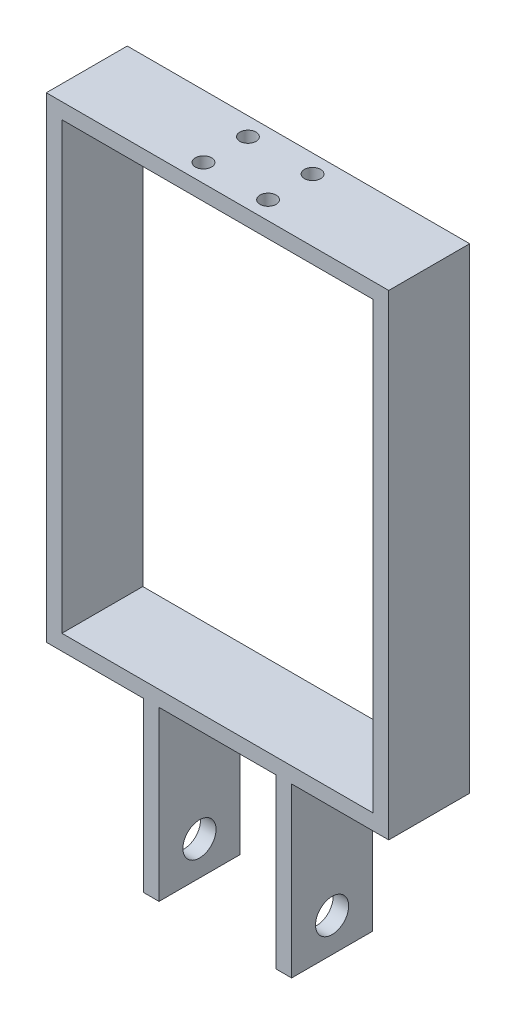
ISO-10303-21;
HEADER;
FILE_DESCRIPTION(('STEP AP214'),'2;1');
FILE_NAME('part.step','',(''),(''),'','','');
FILE_SCHEMA(('AUTOMOTIVE_DESIGN { 1 0 10303 214 1 1 1 1 }'));
ENDSEC;
DATA;
#1=APPLICATION_CONTEXT('core data for automotive mechanical design processes');
#2=APPLICATION_PROTOCOL_DEFINITION('international standard','automotive_design',2000,#1);
#3=PRODUCT_CONTEXT('',#1,'mechanical');
#4=PRODUCT('Part','Part','',(#3));
#5=PRODUCT_RELATED_PRODUCT_CATEGORY('part','',(#4));
#6=PRODUCT_DEFINITION_FORMATION('','',#4);
#7=PRODUCT_DEFINITION_CONTEXT('part definition',#1,'design');
#8=PRODUCT_DEFINITION('design','',#6,#7);
#9=PRODUCT_DEFINITION_SHAPE('','',#8);
#10=(LENGTH_UNIT() NAMED_UNIT(*) SI_UNIT(.MILLI.,.METRE.));
#11=(NAMED_UNIT(*) PLANE_ANGLE_UNIT() SI_UNIT($,.RADIAN.));
#12=(NAMED_UNIT(*) SI_UNIT($,.STERADIAN.) SOLID_ANGLE_UNIT());
#13=UNCERTAINTY_MEASURE_WITH_UNIT(LENGTH_MEASURE(1.E-05),#10,'distance_accuracy_value','');
#14=(GEOMETRIC_REPRESENTATION_CONTEXT(3) GLOBAL_UNCERTAINTY_ASSIGNED_CONTEXT((#13)) GLOBAL_UNIT_ASSIGNED_CONTEXT((#10,
#11,#12)) REPRESENTATION_CONTEXT('',''));
#15=CARTESIAN_POINT('',(0.,0.,0.));
#16=DIRECTION('',(0.,0.,1.));
#17=DIRECTION('',(1.,0.,0.));
#18=AXIS2_PLACEMENT_3D('',#15,#16,#17);
#19=CARTESIAN_POINT('',(0.,0.,16.51));
#20=DIRECTION('',(0.,0.,1.));
#21=DIRECTION('',(1.,0.,0.));
#22=AXIS2_PLACEMENT_3D('',#19,#20,#21);
#23=PLANE('',#22);
#24=DIRECTION('',(0.,-1.,0.));
#25=VECTOR('',#24,1.);
#26=CARTESIAN_POINT('',(0.,0.,16.51));
#27=LINE('',#26,#25);
#28=CARTESIAN_POINT('',(0.,34.29,16.51));
#29=VERTEX_POINT('',#28);
#30=CARTESIAN_POINT('',(0.,0.,16.51));
#31=VERTEX_POINT('',#30);
#32=EDGE_CURVE('E211',#29,#31,#27,.T.);
#33=ORIENTED_EDGE('',*,*,#32,.T.);
#34=DIRECTION('',(1.,0.,0.));
#35=VECTOR('',#34,1.);
#36=CARTESIAN_POINT('',(0.,0.,16.51));
#37=LINE('',#36,#35);
#38=CARTESIAN_POINT('',(3.175,0.,16.51));
#39=VERTEX_POINT('',#38);
#40=EDGE_CURVE('E215',#31,#39,#37,.T.);
#41=ORIENTED_EDGE('',*,*,#40,.T.);
#42=DIRECTION('',(0.,1.,0.));
#43=VECTOR('',#42,1.);
#44=CARTESIAN_POINT('',(3.175,0.,16.51));
#45=LINE('',#44,#43);
#46=CARTESIAN_POINT('',(3.175,34.29,16.51));
#47=VERTEX_POINT('',#46);
#48=EDGE_CURVE('E219',#39,#47,#45,.T.);
#49=ORIENTED_EDGE('',*,*,#48,.T.);
#50=DIRECTION('',(1.,0.,0.));
#51=VECTOR('',#50,1.);
#52=CARTESIAN_POINT('',(3.175,34.29,16.51));
#53=LINE('',#52,#51);
#54=CARTESIAN_POINT('',(27.051,34.29,16.51));
#55=VERTEX_POINT('',#54);
#56=EDGE_CURVE('E222',#47,#55,#53,.T.);
#57=ORIENTED_EDGE('',*,*,#56,.T.);
#58=DIRECTION('',(0.,-1.,0.));
#59=VECTOR('',#58,1.);
#60=CARTESIAN_POINT('',(27.051,34.29,16.51));
#61=LINE('',#60,#59);
#62=CARTESIAN_POINT('',(27.051,0.,16.51));
#63=VERTEX_POINT('',#62);
#64=EDGE_CURVE('E225',#55,#63,#61,.T.);
#65=ORIENTED_EDGE('',*,*,#64,.T.);
#66=DIRECTION('',(1.,0.,0.));
#67=VECTOR('',#66,1.);
#68=CARTESIAN_POINT('',(27.051,0.,16.51));
#69=LINE('',#68,#67);
#70=CARTESIAN_POINT('',(30.226,0.,16.51));
#71=VERTEX_POINT('',#70);
#72=EDGE_CURVE('E228',#63,#71,#69,.T.);
#73=ORIENTED_EDGE('',*,*,#72,.T.);
#74=DIRECTION('',(0.,1.,0.));
#75=VECTOR('',#74,1.);
#76=CARTESIAN_POINT('',(30.226,0.,16.51));
#77=LINE('',#76,#75);
#78=CARTESIAN_POINT('',(30.226,34.29,16.51));
#79=VERTEX_POINT('',#78);
#80=EDGE_CURVE('E231',#71,#79,#77,.T.);
#81=ORIENTED_EDGE('',*,*,#80,.T.);
#82=DIRECTION('',(1.,0.,0.));
#83=VECTOR('',#82,1.);
#84=CARTESIAN_POINT('',(50.038,34.29,16.51));
#85=LINE('',#84,#83);
#86=CARTESIAN_POINT('',(50.038,34.29,16.51));
#87=VERTEX_POINT('',#86);
#88=EDGE_CURVE('E234',#79,#87,#85,.T.);
#89=ORIENTED_EDGE('',*,*,#88,.T.);
#90=DIRECTION('',(0.,1.,0.));
#91=VECTOR('',#90,1.);
#92=CARTESIAN_POINT('',(50.038,131.3688,16.51));
#93=LINE('',#92,#91);
#94=CARTESIAN_POINT('',(50.038,131.3688,16.51));
#95=VERTEX_POINT('',#94);
#96=EDGE_CURVE('E237',#87,#95,#93,.T.);
#97=ORIENTED_EDGE('',*,*,#96,.T.);
#98=DIRECTION('',(-1.,0.,0.));
#99=VECTOR('',#98,1.);
#100=CARTESIAN_POINT('',(-19.812,131.3688,16.51));
#101=LINE('',#100,#99);
#102=CARTESIAN_POINT('',(-19.812,131.3688,16.51));
#103=VERTEX_POINT('',#102);
#104=EDGE_CURVE('E240',#95,#103,#101,.T.);
#105=ORIENTED_EDGE('',*,*,#104,.T.);
#106=DIRECTION('',(0.,-1.,0.));
#107=VECTOR('',#106,1.);
#108=CARTESIAN_POINT('',(-19.812,34.29,16.51));
#109=LINE('',#108,#107);
#110=CARTESIAN_POINT('',(-19.812,34.29,16.51));
#111=VERTEX_POINT('',#110);
#112=EDGE_CURVE('E243',#103,#111,#109,.T.);
#113=ORIENTED_EDGE('',*,*,#112,.T.);
#114=DIRECTION('',(1.,0.,0.));
#115=VECTOR('',#114,1.);
#116=CARTESIAN_POINT('',(0.,34.29,16.51));
#117=LINE('',#116,#115);
#118=EDGE_CURVE('E246',#111,#29,#117,.T.);
#119=ORIENTED_EDGE('',*,*,#118,.T.);
#120=EDGE_LOOP('',(#33,#41,#49,#57,#65,#73,#81,#89,#97,#105,#113,#119));
#121=FACE_BOUND('',#120,.T.);
#122=DIRECTION('',(1.,0.,0.));
#123=VECTOR('',#122,1.);
#124=CARTESIAN_POINT('',(-16.637,37.465,16.51));
#125=LINE('',#124,#123);
#126=CARTESIAN_POINT('',(-16.637,37.465,16.51));
#127=VERTEX_POINT('',#126);
#128=CARTESIAN_POINT('',(46.863,37.465,16.51));
#129=VERTEX_POINT('',#128);
#130=EDGE_CURVE('E170',#127,#129,#125,.T.);
#131=ORIENTED_EDGE('',*,*,#130,.F.);
#132=DIRECTION('',(0.,-1.,0.));
#133=VECTOR('',#132,1.);
#134=CARTESIAN_POINT('',(-16.637,128.1938,16.51));
#135=LINE('',#134,#133);
#136=CARTESIAN_POINT('',(-16.637,128.1938,16.51));
#137=VERTEX_POINT('',#136);
#138=EDGE_CURVE('E161',#137,#127,#135,.T.);
#139=ORIENTED_EDGE('',*,*,#138,.F.);
#140=DIRECTION('',(-1.,0.,0.));
#141=VECTOR('',#140,1.);
#142=CARTESIAN_POINT('',(46.863,128.1938,16.51));
#143=LINE('',#142,#141);
#144=CARTESIAN_POINT('',(46.863,128.1938,16.51));
#145=VERTEX_POINT('',#144);
#146=EDGE_CURVE('E187',#145,#137,#143,.T.);
#147=ORIENTED_EDGE('',*,*,#146,.F.);
#148=DIRECTION('',(0.,1.,0.));
#149=VECTOR('',#148,1.);
#150=CARTESIAN_POINT('',(46.863,37.465,16.51));
#151=LINE('',#150,#149);
#152=EDGE_CURVE('E183',#129,#145,#151,.T.);
#153=ORIENTED_EDGE('',*,*,#152,.F.);
#154=EDGE_LOOP('',(#131,#139,#147,#153));
#155=FACE_BOUND('',#154,.T.);
#156=ADVANCED_FACE('F45',(#121,#155),#23,.T.);
#157=CARTESIAN_POINT('',(0.,0.,0.));
#158=DIRECTION('',(0.,0.,1.));
#159=DIRECTION('',(1.,0.,0.));
#160=AXIS2_PLACEMENT_3D('',#157,#158,#159);
#161=PLANE('',#160);
#162=DIRECTION('',(0.,-1.,0.));
#163=VECTOR('',#162,1.);
#164=CARTESIAN_POINT('',(0.,0.,0.));
#165=LINE('',#164,#163);
#166=CARTESIAN_POINT('',(0.,34.29,0.));
#167=VERTEX_POINT('',#166);
#168=CARTESIAN_POINT('',(0.,0.,0.));
#169=VERTEX_POINT('',#168);
#170=EDGE_CURVE('E179',#167,#169,#165,.T.);
#171=ORIENTED_EDGE('',*,*,#170,.F.);
#172=DIRECTION('',(1.,0.,0.));
#173=VECTOR('',#172,1.);
#174=CARTESIAN_POINT('',(0.,34.29,0.));
#175=LINE('',#174,#173);
#176=CARTESIAN_POINT('',(-19.812,34.29,0.));
#177=VERTEX_POINT('',#176);
#178=EDGE_CURVE('E216',#177,#167,#175,.T.);
#179=ORIENTED_EDGE('',*,*,#178,.F.);
#180=DIRECTION('',(0.,-1.,0.));
#181=VECTOR('',#180,1.);
#182=CARTESIAN_POINT('',(-19.812,34.29,0.));
#183=LINE('',#182,#181);
#184=CARTESIAN_POINT('',(-19.812,131.3688,0.));
#185=VERTEX_POINT('',#184);
#186=EDGE_CURVE('E280',#185,#177,#183,.T.);
#187=ORIENTED_EDGE('',*,*,#186,.F.);
#188=DIRECTION('',(-1.,0.,0.));
#189=VECTOR('',#188,1.);
#190=CARTESIAN_POINT('',(-19.812,131.3688,0.));
#191=LINE('',#190,#189);
#192=CARTESIAN_POINT('',(50.038,131.3688,0.));
#193=VERTEX_POINT('',#192);
#194=EDGE_CURVE('E277',#193,#185,#191,.T.);
#195=ORIENTED_EDGE('',*,*,#194,.F.);
#196=DIRECTION('',(0.,1.,0.));
#197=VECTOR('',#196,1.);
#198=CARTESIAN_POINT('',(50.038,131.3688,0.));
#199=LINE('',#198,#197);
#200=CARTESIAN_POINT('',(50.038,34.29,0.));
#201=VERTEX_POINT('',#200);
#202=EDGE_CURVE('E274',#201,#193,#199,.T.);
#203=ORIENTED_EDGE('',*,*,#202,.F.);
#204=DIRECTION('',(1.,0.,0.));
#205=VECTOR('',#204,1.);
#206=CARTESIAN_POINT('',(50.038,34.29,0.));
#207=LINE('',#206,#205);
#208=CARTESIAN_POINT('',(30.226,34.29,0.));
#209=VERTEX_POINT('',#208);
#210=EDGE_CURVE('E271',#209,#201,#207,.T.);
#211=ORIENTED_EDGE('',*,*,#210,.F.);
#212=DIRECTION('',(0.,1.,0.));
#213=VECTOR('',#212,1.);
#214=CARTESIAN_POINT('',(30.226,0.,0.));
#215=LINE('',#214,#213);
#216=CARTESIAN_POINT('',(30.226,0.,0.));
#217=VERTEX_POINT('',#216);
#218=EDGE_CURVE('E268',#217,#209,#215,.T.);
#219=ORIENTED_EDGE('',*,*,#218,.F.);
#220=DIRECTION('',(1.,0.,0.));
#221=VECTOR('',#220,1.);
#222=CARTESIAN_POINT('',(27.051,0.,0.));
#223=LINE('',#222,#221);
#224=CARTESIAN_POINT('',(27.051,0.,0.));
#225=VERTEX_POINT('',#224);
#226=EDGE_CURVE('E265',#225,#217,#223,.T.);
#227=ORIENTED_EDGE('',*,*,#226,.F.);
#228=DIRECTION('',(0.,-1.,0.));
#229=VECTOR('',#228,1.);
#230=CARTESIAN_POINT('',(27.051,34.29,0.));
#231=LINE('',#230,#229);
#232=CARTESIAN_POINT('',(27.051,34.29,0.));
#233=VERTEX_POINT('',#232);
#234=EDGE_CURVE('E262',#233,#225,#231,.T.);
#235=ORIENTED_EDGE('',*,*,#234,.F.);
#236=DIRECTION('',(1.,0.,0.));
#237=VECTOR('',#236,1.);
#238=CARTESIAN_POINT('',(3.175,34.29,0.));
#239=LINE('',#238,#237);
#240=CARTESIAN_POINT('',(3.175,34.29,0.));
#241=VERTEX_POINT('',#240);
#242=EDGE_CURVE('E259',#241,#233,#239,.T.);
#243=ORIENTED_EDGE('',*,*,#242,.F.);
#244=DIRECTION('',(0.,1.,0.));
#245=VECTOR('',#244,1.);
#246=CARTESIAN_POINT('',(3.175,0.,0.));
#247=LINE('',#246,#245);
#248=CARTESIAN_POINT('',(3.175,0.,0.));
#249=VERTEX_POINT('',#248);
#250=EDGE_CURVE('E256',#249,#241,#247,.T.);
#251=ORIENTED_EDGE('',*,*,#250,.F.);
#252=DIRECTION('',(1.,0.,0.));
#253=VECTOR('',#252,1.);
#254=CARTESIAN_POINT('',(0.,0.,0.));
#255=LINE('',#254,#253);
#256=EDGE_CURVE('E253',#169,#249,#255,.T.);
#257=ORIENTED_EDGE('',*,*,#256,.F.);
#258=EDGE_LOOP('',(#171,#179,#187,#195,#203,#211,#219,#227,#235,#243,#251,#257));
#259=FACE_BOUND('',#258,.T.);
#260=DIRECTION('',(0.,-1.,0.));
#261=VECTOR('',#260,1.);
#262=CARTESIAN_POINT('',(-16.637,128.1938,0.));
#263=LINE('',#262,#261);
#264=CARTESIAN_POINT('',(-16.637,128.1938,0.));
#265=VERTEX_POINT('',#264);
#266=CARTESIAN_POINT('',(-16.637,37.465,0.));
#267=VERTEX_POINT('',#266);
#268=EDGE_CURVE('E71',#265,#267,#263,.T.);
#269=ORIENTED_EDGE('',*,*,#268,.T.);
#270=DIRECTION('',(1.,0.,0.));
#271=VECTOR('',#270,1.);
#272=CARTESIAN_POINT('',(-16.637,37.465,0.));
#273=LINE('',#272,#271);
#274=CARTESIAN_POINT('',(46.863,37.465,0.));
#275=VERTEX_POINT('',#274);
#276=EDGE_CURVE('E177',#267,#275,#273,.T.);
#277=ORIENTED_EDGE('',*,*,#276,.T.);
#278=DIRECTION('',(0.,1.,0.));
#279=VECTOR('',#278,1.);
#280=CARTESIAN_POINT('',(46.863,37.465,0.));
#281=LINE('',#280,#279);
#282=CARTESIAN_POINT('',(46.863,128.1938,0.));
#283=VERTEX_POINT('',#282);
#284=EDGE_CURVE('E198',#275,#283,#281,.T.);
#285=ORIENTED_EDGE('',*,*,#284,.T.);
#286=DIRECTION('',(-1.,0.,0.));
#287=VECTOR('',#286,1.);
#288=CARTESIAN_POINT('',(46.863,128.1938,0.));
#289=LINE('',#288,#287);
#290=EDGE_CURVE('E171',#283,#265,#289,.T.);
#291=ORIENTED_EDGE('',*,*,#290,.T.);
#292=EDGE_LOOP('',(#269,#277,#285,#291));
#293=FACE_BOUND('',#292,.T.);
#294=ADVANCED_FACE('F383',(#259,#293),#161,.F.);
#295=CARTESIAN_POINT('',(0.,0.,16.51));
#296=DIRECTION('',(1.,0.,0.));
#297=DIRECTION('',(0.,0.,-1.));
#298=AXIS2_PLACEMENT_3D('',#295,#296,#297);
#299=PLANE('',#298);
#300=CARTESIAN_POINT('',(0.,6.9215,8.255));
#301=DIRECTION('',(-1.,0.,0.));
#302=DIRECTION('',(0.,0.,1.));
#303=AXIS2_PLACEMENT_3D('',#300,#301,#302);
#304=CIRCLE('',#303,3.3782);
#305=CARTESIAN_POINT('',(0.,6.9215,11.6332));
#306=VERTEX_POINT('',#305);
#307=EDGE_CURVE('E332',#306,#306,#304,.T.);
#308=ORIENTED_EDGE('',*,*,#307,.F.);
#309=EDGE_LOOP('',(#308));
#310=FACE_BOUND('',#309,.T.);
#311=ORIENTED_EDGE('',*,*,#170,.T.);
#312=DIRECTION('',(0.,0.,-1.));
#313=VECTOR('',#312,1.);
#314=CARTESIAN_POINT('',(0.,0.,16.51));
#315=LINE('',#314,#313);
#316=EDGE_CURVE('E12',#31,#169,#315,.T.);
#317=ORIENTED_EDGE('',*,*,#316,.F.);
#318=ORIENTED_EDGE('',*,*,#32,.F.);
#319=DIRECTION('',(0.,0.,-1.));
#320=VECTOR('',#319,1.);
#321=CARTESIAN_POINT('',(0.,34.29,16.51));
#322=LINE('',#321,#320);
#323=EDGE_CURVE('E249',#29,#167,#322,.T.);
#324=ORIENTED_EDGE('',*,*,#323,.T.);
#325=EDGE_LOOP('',(#311,#317,#318,#324));
#326=FACE_BOUND('',#325,.T.);
#327=ADVANCED_FACE('F47',(#310,#326),#299,.F.);
#328=CARTESIAN_POINT('',(0.,0.,16.51));
#329=DIRECTION('',(0.,1.,0.));
#330=DIRECTION('',(0.,0.,1.));
#331=AXIS2_PLACEMENT_3D('',#328,#329,#330);
#332=PLANE('',#331);
#333=ORIENTED_EDGE('',*,*,#256,.T.);
#334=DIRECTION('',(0.,0.,-1.));
#335=VECTOR('',#334,1.);
#336=CARTESIAN_POINT('',(3.175,0.,16.51));
#337=LINE('',#336,#335);
#338=EDGE_CURVE('E55',#39,#249,#337,.T.);
#339=ORIENTED_EDGE('',*,*,#338,.F.);
#340=ORIENTED_EDGE('',*,*,#40,.F.);
#341=ORIENTED_EDGE('',*,*,#316,.T.);
#342=EDGE_LOOP('',(#333,#339,#340,#341));
#343=FACE_BOUND('',#342,.T.);
#344=ADVANCED_FACE('F431',(#343),#332,.F.);
#345=CARTESIAN_POINT('',(3.175,0.,16.51));
#346=DIRECTION('',(-1.,0.,0.));
#347=DIRECTION('',(0.,0.,1.));
#348=AXIS2_PLACEMENT_3D('',#345,#346,#347);
#349=PLANE('',#348);
#350=CARTESIAN_POINT('',(3.175,6.9215,8.255));
#351=DIRECTION('',(-1.,0.,0.));
#352=DIRECTION('',(0.,0.,1.));
#353=AXIS2_PLACEMENT_3D('',#350,#351,#352);
#354=CIRCLE('',#353,3.3782);
#355=CARTESIAN_POINT('',(3.175,6.9215,11.6332));
#356=VERTEX_POINT('',#355);
#357=EDGE_CURVE('E195',#356,#356,#354,.T.);
#358=ORIENTED_EDGE('',*,*,#357,.T.);
#359=EDGE_LOOP('',(#358));
#360=FACE_BOUND('',#359,.T.);
#361=ORIENTED_EDGE('',*,*,#250,.T.);
#362=DIRECTION('',(0.,0.,-1.));
#363=VECTOR('',#362,1.);
#364=CARTESIAN_POINT('',(3.175,34.29,16.51));
#365=LINE('',#364,#363);
#366=EDGE_CURVE('E320',#47,#241,#365,.T.);
#367=ORIENTED_EDGE('',*,*,#366,.F.);
#368=ORIENTED_EDGE('',*,*,#48,.F.);
#369=ORIENTED_EDGE('',*,*,#338,.T.);
#370=EDGE_LOOP('',(#361,#367,#368,#369));
#371=FACE_BOUND('',#370,.T.);
#372=ADVANCED_FACE('F364',(#360,#371),#349,.F.);
#373=CARTESIAN_POINT('',(3.175,34.29,16.51));
#374=DIRECTION('',(0.,1.,0.));
#375=DIRECTION('',(0.,0.,1.));
#376=AXIS2_PLACEMENT_3D('',#373,#374,#375);
#377=PLANE('',#376);
#378=ORIENTED_EDGE('',*,*,#242,.T.);
#379=DIRECTION('',(0.,0.,-1.));
#380=VECTOR('',#379,1.);
#381=CARTESIAN_POINT('',(27.051,34.29,16.51));
#382=LINE('',#381,#380);
#383=EDGE_CURVE('E316',#55,#233,#382,.T.);
#384=ORIENTED_EDGE('',*,*,#383,.F.);
#385=ORIENTED_EDGE('',*,*,#56,.F.);
#386=ORIENTED_EDGE('',*,*,#366,.T.);
#387=EDGE_LOOP('',(#378,#384,#385,#386));
#388=FACE_BOUND('',#387,.T.);
#389=ADVANCED_FACE('F425',(#388),#377,.F.);
#390=CARTESIAN_POINT('',(27.051,34.29,16.51));
#391=DIRECTION('',(1.,0.,0.));
#392=DIRECTION('',(0.,1.,0.));
#393=AXIS2_PLACEMENT_3D('',#390,#391,#392);
#394=PLANE('',#393);
#395=CARTESIAN_POINT('',(27.051,6.9215,8.255));
#396=DIRECTION('',(1.,0.,0.));
#397=DIRECTION('',(0.,1.,0.));
#398=AXIS2_PLACEMENT_3D('',#395,#396,#397);
#399=CIRCLE('',#398,3.3782);
#400=CARTESIAN_POINT('',(27.051,10.2997,8.255));
#401=VERTEX_POINT('',#400);
#402=EDGE_CURVE('E331',#401,#401,#399,.T.);
#403=ORIENTED_EDGE('',*,*,#402,.T.);
#404=EDGE_LOOP('',(#403));
#405=FACE_BOUND('',#404,.T.);
#406=ORIENTED_EDGE('',*,*,#234,.T.);
#407=DIRECTION('',(0.,0.,-1.));
#408=VECTOR('',#407,1.);
#409=CARTESIAN_POINT('',(27.051,0.,16.51));
#410=LINE('',#409,#408);
#411=EDGE_CURVE('E312',#63,#225,#410,.T.);
#412=ORIENTED_EDGE('',*,*,#411,.F.);
#413=ORIENTED_EDGE('',*,*,#64,.F.);
#414=ORIENTED_EDGE('',*,*,#383,.T.);
#415=EDGE_LOOP('',(#406,#412,#413,#414));
#416=FACE_BOUND('',#415,.T.);
#417=ADVANCED_FACE('F421',(#405,#416),#394,.F.);
#418=CARTESIAN_POINT('',(27.051,0.,16.51));
#419=DIRECTION('',(0.,1.,0.));
#420=DIRECTION('',(0.,0.,1.));
#421=AXIS2_PLACEMENT_3D('',#418,#419,#420);
#422=PLANE('',#421);
#423=ORIENTED_EDGE('',*,*,#226,.T.);
#424=DIRECTION('',(0.,0.,-1.));
#425=VECTOR('',#424,1.);
#426=CARTESIAN_POINT('',(30.226,0.,16.51));
#427=LINE('',#426,#425);
#428=EDGE_CURVE('E308',#71,#217,#427,.T.);
#429=ORIENTED_EDGE('',*,*,#428,.F.);
#430=ORIENTED_EDGE('',*,*,#72,.F.);
#431=ORIENTED_EDGE('',*,*,#411,.T.);
#432=EDGE_LOOP('',(#423,#429,#430,#431));
#433=FACE_BOUND('',#432,.T.);
#434=ADVANCED_FACE('F417',(#433),#422,.F.);
#435=CARTESIAN_POINT('',(30.226,0.,16.51));
#436=DIRECTION('',(-1.,0.,0.));
#437=DIRECTION('',(0.,0.,1.));
#438=AXIS2_PLACEMENT_3D('',#435,#436,#437);
#439=PLANE('',#438);
#440=CARTESIAN_POINT('',(30.226,6.9215,8.255));
#441=DIRECTION('',(-1.,0.,0.));
#442=DIRECTION('',(0.,0.,1.));
#443=AXIS2_PLACEMENT_3D('',#440,#441,#442);
#444=CIRCLE('',#443,3.3782);
#445=CARTESIAN_POINT('',(30.226,6.9215,11.6332));
#446=VERTEX_POINT('',#445);
#447=EDGE_CURVE('E327',#446,#446,#444,.T.);
#448=ORIENTED_EDGE('',*,*,#447,.T.);
#449=EDGE_LOOP('',(#448));
#450=FACE_BOUND('',#449,.T.);
#451=ORIENTED_EDGE('',*,*,#218,.T.);
#452=DIRECTION('',(0.,0.,-1.));
#453=VECTOR('',#452,1.);
#454=CARTESIAN_POINT('',(30.226,34.29,16.51));
#455=LINE('',#454,#453);
#456=EDGE_CURVE('E304',#79,#209,#455,.T.);
#457=ORIENTED_EDGE('',*,*,#456,.F.);
#458=ORIENTED_EDGE('',*,*,#80,.F.);
#459=ORIENTED_EDGE('',*,*,#428,.T.);
#460=EDGE_LOOP('',(#451,#457,#458,#459));
#461=FACE_BOUND('',#460,.T.);
#462=ADVANCED_FACE('F413',(#450,#461),#439,.F.);
#463=CARTESIAN_POINT('',(50.038,34.29,16.51));
#464=DIRECTION('',(0.,1.,0.));
#465=DIRECTION('',(0.,0.,1.));
#466=AXIS2_PLACEMENT_3D('',#463,#464,#465);
#467=PLANE('',#466);
#468=ORIENTED_EDGE('',*,*,#210,.T.);
#469=DIRECTION('',(0.,0.,-1.));
#470=VECTOR('',#469,1.);
#471=CARTESIAN_POINT('',(50.038,34.29,16.51));
#472=LINE('',#471,#470);
#473=EDGE_CURVE('E300',#87,#201,#472,.T.);
#474=ORIENTED_EDGE('',*,*,#473,.F.);
#475=ORIENTED_EDGE('',*,*,#88,.F.);
#476=ORIENTED_EDGE('',*,*,#456,.T.);
#477=EDGE_LOOP('',(#468,#474,#475,#476));
#478=FACE_BOUND('',#477,.T.);
#479=ADVANCED_FACE('F409',(#478),#467,.F.);
#480=CARTESIAN_POINT('',(50.038,131.3688,16.51));
#481=DIRECTION('',(-1.,0.,0.));
#482=DIRECTION('',(0.,-1.,0.));
#483=AXIS2_PLACEMENT_3D('',#480,#481,#482);
#484=PLANE('',#483);
#485=ORIENTED_EDGE('',*,*,#202,.T.);
#486=DIRECTION('',(0.,0.,-1.));
#487=VECTOR('',#486,1.);
#488=CARTESIAN_POINT('',(50.038,131.3688,16.51));
#489=LINE('',#488,#487);
#490=EDGE_CURVE('E296',#95,#193,#489,.T.);
#491=ORIENTED_EDGE('',*,*,#490,.F.);
#492=ORIENTED_EDGE('',*,*,#96,.F.);
#493=ORIENTED_EDGE('',*,*,#473,.T.);
#494=EDGE_LOOP('',(#485,#491,#492,#493));
#495=FACE_BOUND('',#494,.T.);
#496=ADVANCED_FACE('F405',(#495),#484,.F.);
#497=CARTESIAN_POINT('',(-19.812,131.3688,16.51));
#498=DIRECTION('',(0.,-1.,0.));
#499=DIRECTION('',(0.,0.,-1.));
#500=AXIS2_PLACEMENT_3D('',#497,#498,#499);
#501=PLANE('',#500);
#502=CARTESIAN_POINT('',(21.702169769775,131.3688,12.7918316857785));
#503=DIRECTION('',(0.,1.,0.));
#504=DIRECTION('',(0.,0.,1.));
#505=AXIS2_PLACEMENT_3D('',#502,#503,#504);
#506=CIRCLE('',#505,1.65);
#507=CARTESIAN_POINT('',(21.702169769775,131.3688,14.4418316857785));
#508=VERTEX_POINT('',#507);
#509=EDGE_CURVE('E627',#508,#508,#506,.T.);
#510=ORIENTED_EDGE('',*,*,#509,.F.);
#511=EDGE_LOOP('',(#510));
#512=FACE_BOUND('',#511,.T.);
#513=CARTESIAN_POINT('',(8.52383023022501,131.3688,3.71816831422154));
#514=DIRECTION('',(0.,1.,0.));
#515=DIRECTION('',(0.,0.,1.));
#516=AXIS2_PLACEMENT_3D('',#513,#514,#515);
#517=CIRCLE('',#516,1.65);
#518=CARTESIAN_POINT('',(8.52383023022501,131.3688,5.36816831422154));
#519=VERTEX_POINT('',#518);
#520=EDGE_CURVE('E629',#519,#519,#517,.T.);
#521=ORIENTED_EDGE('',*,*,#520,.F.);
#522=EDGE_LOOP('',(#521));
#523=FACE_BOUND('',#522,.T.);
#524=CARTESIAN_POINT('',(8.52383023022501,131.3688,12.7918316857785));
#525=DIRECTION('',(0.,1.,0.));
#526=DIRECTION('',(0.,0.,1.));
#527=AXIS2_PLACEMENT_3D('',#524,#525,#526);
#528=CIRCLE('',#527,1.65);
#529=CARTESIAN_POINT('',(8.52383023022501,131.3688,14.4418316857785));
#530=VERTEX_POINT('',#529);
#531=EDGE_CURVE('E632',#530,#530,#528,.T.);
#532=ORIENTED_EDGE('',*,*,#531,.F.);
#533=EDGE_LOOP('',(#532));
#534=FACE_BOUND('',#533,.T.);
#535=CARTESIAN_POINT('',(21.702169769775,131.3688,3.71816831422154));
#536=DIRECTION('',(0.,1.,0.));
#537=DIRECTION('',(0.,0.,1.));
#538=AXIS2_PLACEMENT_3D('',#535,#536,#537);
#539=CIRCLE('',#538,1.65);
#540=CARTESIAN_POINT('',(21.702169769775,131.3688,5.36816831422154));
#541=VERTEX_POINT('',#540);
#542=EDGE_CURVE('E338',#541,#541,#539,.T.);
#543=ORIENTED_EDGE('',*,*,#542,.F.);
#544=EDGE_LOOP('',(#543));
#545=FACE_BOUND('',#544,.T.);
#546=ORIENTED_EDGE('',*,*,#194,.T.);
#547=DIRECTION('',(0.,0.,-1.));
#548=VECTOR('',#547,1.);
#549=CARTESIAN_POINT('',(-19.812,131.3688,16.51));
#550=LINE('',#549,#548);
#551=EDGE_CURVE('E292',#103,#185,#550,.T.);
#552=ORIENTED_EDGE('',*,*,#551,.F.);
#553=ORIENTED_EDGE('',*,*,#104,.F.);
#554=ORIENTED_EDGE('',*,*,#490,.T.);
#555=EDGE_LOOP('',(#546,#552,#553,#554));
#556=FACE_BOUND('',#555,.T.);
#557=ADVANCED_FACE('F401',(#512,#523,#534,#545,#556),#501,.F.);
#558=CARTESIAN_POINT('',(-19.812,34.29,16.51));
#559=DIRECTION('',(1.,0.,0.));
#560=DIRECTION('',(0.,0.,-1.));
#561=AXIS2_PLACEMENT_3D('',#558,#559,#560);
#562=PLANE('',#561);
#563=ORIENTED_EDGE('',*,*,#186,.T.);
#564=DIRECTION('',(0.,0.,-1.));
#565=VECTOR('',#564,1.);
#566=CARTESIAN_POINT('',(-19.812,34.29,16.51));
#567=LINE('',#566,#565);
#568=EDGE_CURVE('E288',#111,#177,#567,.T.);
#569=ORIENTED_EDGE('',*,*,#568,.F.);
#570=ORIENTED_EDGE('',*,*,#112,.F.);
#571=ORIENTED_EDGE('',*,*,#551,.T.);
#572=EDGE_LOOP('',(#563,#569,#570,#571));
#573=FACE_BOUND('',#572,.T.);
#574=ADVANCED_FACE('F397',(#573),#562,.F.);
#575=CARTESIAN_POINT('',(0.,34.29,16.51));
#576=DIRECTION('',(0.,1.,0.));
#577=DIRECTION('',(0.,0.,1.));
#578=AXIS2_PLACEMENT_3D('',#575,#576,#577);
#579=PLANE('',#578);
#580=ORIENTED_EDGE('',*,*,#178,.T.);
#581=ORIENTED_EDGE('',*,*,#323,.F.);
#582=ORIENTED_EDGE('',*,*,#118,.F.);
#583=ORIENTED_EDGE('',*,*,#568,.T.);
#584=EDGE_LOOP('',(#580,#581,#582,#583));
#585=FACE_BOUND('',#584,.T.);
#586=ADVANCED_FACE('F394',(#585),#579,.F.);
#587=CARTESIAN_POINT('',(-16.637,128.1938,16.51));
#588=DIRECTION('',(1.,0.,0.));
#589=DIRECTION('',(0.,1.,0.));
#590=AXIS2_PLACEMENT_3D('',#587,#588,#589);
#591=PLANE('',#590);
#592=ORIENTED_EDGE('',*,*,#268,.F.);
#593=DIRECTION('',(0.,0.,-1.));
#594=VECTOR('',#593,1.);
#595=CARTESIAN_POINT('',(-16.637,128.1938,16.51));
#596=LINE('',#595,#594);
#597=EDGE_CURVE('E165',#137,#265,#596,.T.);
#598=ORIENTED_EDGE('',*,*,#597,.F.);
#599=ORIENTED_EDGE('',*,*,#138,.T.);
#600=DIRECTION('',(0.,0.,-1.));
#601=VECTOR('',#600,1.);
#602=CARTESIAN_POINT('',(-16.637,37.465,16.51));
#603=LINE('',#602,#601);
#604=EDGE_CURVE('E164',#127,#267,#603,.T.);
#605=ORIENTED_EDGE('',*,*,#604,.T.);
#606=EDGE_LOOP('',(#592,#598,#599,#605));
#607=FACE_BOUND('',#606,.T.);
#608=ADVANCED_FACE('F163',(#607),#591,.T.);
#609=CARTESIAN_POINT('',(-16.637,37.465,16.51));
#610=DIRECTION('',(0.,1.,0.));
#611=DIRECTION('',(0.,0.,1.));
#612=AXIS2_PLACEMENT_3D('',#609,#610,#611);
#613=PLANE('',#612);
#614=ORIENTED_EDGE('',*,*,#276,.F.);
#615=ORIENTED_EDGE('',*,*,#604,.F.);
#616=ORIENTED_EDGE('',*,*,#130,.T.);
#617=DIRECTION('',(0.,0.,-1.));
#618=VECTOR('',#617,1.);
#619=CARTESIAN_POINT('',(46.863,37.465,16.51));
#620=LINE('',#619,#618);
#621=EDGE_CURVE('E180',#129,#275,#620,.T.);
#622=ORIENTED_EDGE('',*,*,#621,.T.);
#623=EDGE_LOOP('',(#614,#615,#616,#622));
#624=FACE_BOUND('',#623,.T.);
#625=ADVANCED_FACE('F174',(#624),#613,.T.);
#626=CARTESIAN_POINT('',(46.863,37.465,16.51));
#627=DIRECTION('',(-1.,0.,0.));
#628=DIRECTION('',(0.,0.,1.));
#629=AXIS2_PLACEMENT_3D('',#626,#627,#628);
#630=PLANE('',#629);
#631=ORIENTED_EDGE('',*,*,#284,.F.);
#632=ORIENTED_EDGE('',*,*,#621,.F.);
#633=ORIENTED_EDGE('',*,*,#152,.T.);
#634=DIRECTION('',(0.,0.,-1.));
#635=VECTOR('',#634,1.);
#636=CARTESIAN_POINT('',(46.863,128.1938,16.51));
#637=LINE('',#636,#635);
#638=EDGE_CURVE('E63',#145,#283,#637,.T.);
#639=ORIENTED_EDGE('',*,*,#638,.T.);
#640=EDGE_LOOP('',(#631,#632,#633,#639));
#641=FACE_BOUND('',#640,.T.);
#642=ADVANCED_FACE('F479',(#641),#630,.T.);
#643=CARTESIAN_POINT('',(46.863,128.1938,16.51));
#644=DIRECTION('',(0.,-1.,0.));
#645=DIRECTION('',(0.,0.,-1.));
#646=AXIS2_PLACEMENT_3D('',#643,#644,#645);
#647=PLANE('',#646);
#648=CARTESIAN_POINT('',(21.702169769775,128.1938,12.7918316857785));
#649=DIRECTION('',(0.,-1.,0.));
#650=DIRECTION('',(0.,0.,-1.));
#651=AXIS2_PLACEMENT_3D('',#648,#649,#650);
#652=CIRCLE('',#651,1.65);
#653=CARTESIAN_POINT('',(21.702169769775,128.1938,11.1418316857785));
#654=VERTEX_POINT('',#653);
#655=EDGE_CURVE('E49',#654,#654,#652,.T.);
#656=ORIENTED_EDGE('',*,*,#655,.F.);
#657=EDGE_LOOP('',(#656));
#658=FACE_BOUND('',#657,.T.);
#659=CARTESIAN_POINT('',(8.52383023022501,128.1938,3.71816831422154));
#660=DIRECTION('',(0.,-1.,0.));
#661=DIRECTION('',(0.,0.,-1.));
#662=AXIS2_PLACEMENT_3D('',#659,#660,#661);
#663=CIRCLE('',#662,1.65);
#664=CARTESIAN_POINT('',(8.52383023022501,128.1938,2.06816831422154));
#665=VERTEX_POINT('',#664);
#666=EDGE_CURVE('E341',#665,#665,#663,.T.);
#667=ORIENTED_EDGE('',*,*,#666,.F.);
#668=EDGE_LOOP('',(#667));
#669=FACE_BOUND('',#668,.T.);
#670=CARTESIAN_POINT('',(8.52383023022501,128.1938,12.7918316857785));
#671=DIRECTION('',(0.,-1.,0.));
#672=DIRECTION('',(0.,0.,-1.));
#673=AXIS2_PLACEMENT_3D('',#670,#671,#672);
#674=CIRCLE('',#673,1.65);
#675=CARTESIAN_POINT('',(8.52383023022501,128.1938,11.1418316857785));
#676=VERTEX_POINT('',#675);
#677=EDGE_CURVE('E337',#676,#676,#674,.T.);
#678=ORIENTED_EDGE('',*,*,#677,.F.);
#679=EDGE_LOOP('',(#678));
#680=FACE_BOUND('',#679,.T.);
#681=CARTESIAN_POINT('',(21.702169769775,128.1938,3.71816831422154));
#682=DIRECTION('',(0.,-1.,0.));
#683=DIRECTION('',(0.,0.,-1.));
#684=AXIS2_PLACEMENT_3D('',#681,#682,#683);
#685=CIRCLE('',#684,1.65);
#686=CARTESIAN_POINT('',(21.702169769775,128.1938,2.06816831422154));
#687=VERTEX_POINT('',#686);
#688=EDGE_CURVE('E333',#687,#687,#685,.T.);
#689=ORIENTED_EDGE('',*,*,#688,.F.);
#690=EDGE_LOOP('',(#689));
#691=FACE_BOUND('',#690,.T.);
#692=ORIENTED_EDGE('',*,*,#290,.F.);
#693=ORIENTED_EDGE('',*,*,#638,.F.);
#694=ORIENTED_EDGE('',*,*,#146,.T.);
#695=ORIENTED_EDGE('',*,*,#597,.T.);
#696=EDGE_LOOP('',(#692,#693,#694,#695));
#697=FACE_BOUND('',#696,.T.);
#698=ADVANCED_FACE('F379',(#658,#669,#680,#691,#697),#647,.T.);
#699=CARTESIAN_POINT('',(42.672,6.9215,8.255));
#700=DIRECTION('',(-1.,0.,0.));
#701=DIRECTION('',(0.,0.,1.));
#702=AXIS2_PLACEMENT_3D('',#699,#700,#701);
#703=CYLINDRICAL_SURFACE('',#702,3.3782);
#704=ORIENTED_EDGE('',*,*,#447,.F.);
#705=EDGE_LOOP('',(#704));
#706=FACE_BOUND('',#705,.T.);
#707=ORIENTED_EDGE('',*,*,#402,.F.);
#708=EDGE_LOOP('',(#707));
#709=FACE_BOUND('',#708,.T.);
#710=ADVANCED_FACE('F370',(#706,#709),#703,.F.);
#711=ORIENTED_EDGE('',*,*,#307,.T.);
#712=EDGE_LOOP('',(#711));
#713=FACE_BOUND('',#712,.T.);
#714=ORIENTED_EDGE('',*,*,#357,.F.);
#715=EDGE_LOOP('',(#714));
#716=FACE_BOUND('',#715,.T.);
#717=ADVANCED_FACE('F367',(#713,#716),#703,.F.);
#718=CARTESIAN_POINT('',(21.702169769775,88.6968,3.71816831422154));
#719=DIRECTION('',(0.,1.,0.));
#720=DIRECTION('',(0.,0.,1.));
#721=AXIS2_PLACEMENT_3D('',#718,#719,#720);
#722=CYLINDRICAL_SURFACE('',#721,1.65);
#723=ORIENTED_EDGE('',*,*,#688,.T.);
#724=EDGE_LOOP('',(#723));
#725=FACE_BOUND('',#724,.T.);
#726=ORIENTED_EDGE('',*,*,#542,.T.);
#727=EDGE_LOOP('',(#726));
#728=FACE_BOUND('',#727,.T.);
#729=ADVANCED_FACE('F369',(#725,#728),#722,.F.);
#730=CARTESIAN_POINT('',(8.52383023022501,88.6968,12.7918316857785));
#731=DIRECTION('',(0.,1.,0.));
#732=DIRECTION('',(0.,0.,1.));
#733=AXIS2_PLACEMENT_3D('',#730,#731,#732);
#734=CYLINDRICAL_SURFACE('',#733,1.65);
#735=ORIENTED_EDGE('',*,*,#677,.T.);
#736=EDGE_LOOP('',(#735));
#737=FACE_BOUND('',#736,.T.);
#738=ORIENTED_EDGE('',*,*,#531,.T.);
#739=EDGE_LOOP('',(#738));
#740=FACE_BOUND('',#739,.T.);
#741=ADVANCED_FACE('F376',(#737,#740),#734,.F.);
#742=CARTESIAN_POINT('',(8.52383023022501,88.6968,3.71816831422154));
#743=DIRECTION('',(0.,1.,0.));
#744=DIRECTION('',(0.,0.,1.));
#745=AXIS2_PLACEMENT_3D('',#742,#743,#744);
#746=CYLINDRICAL_SURFACE('',#745,1.65);
#747=ORIENTED_EDGE('',*,*,#666,.T.);
#748=EDGE_LOOP('',(#747));
#749=FACE_BOUND('',#748,.T.);
#750=ORIENTED_EDGE('',*,*,#520,.T.);
#751=EDGE_LOOP('',(#750));
#752=FACE_BOUND('',#751,.T.);
#753=ADVANCED_FACE('F599',(#749,#752),#746,.F.);
#754=CARTESIAN_POINT('',(21.702169769775,88.6968,12.7918316857785));
#755=DIRECTION('',(0.,1.,0.));
#756=DIRECTION('',(0.,0.,1.));
#757=AXIS2_PLACEMENT_3D('',#754,#755,#756);
#758=CYLINDRICAL_SURFACE('',#757,1.65);
#759=ORIENTED_EDGE('',*,*,#655,.T.);
#760=EDGE_LOOP('',(#759));
#761=FACE_BOUND('',#760,.T.);
#762=ORIENTED_EDGE('',*,*,#509,.T.);
#763=EDGE_LOOP('',(#762));
#764=FACE_BOUND('',#763,.T.);
#765=ADVANCED_FACE('F608',(#761,#764),#758,.F.);
#766=CLOSED_SHELL('',(#156,#294,#327,#344,#372,#389,#417,#434,#462,#479,#496,#557,#574,#586,
#608,#625,#642,#698,#710,#717,#729,#741,#753,#765));
#767=MANIFOLD_SOLID_BREP('B2',#766);
#768=ADVANCED_BREP_SHAPE_REPRESENTATION('',(#18,#767),#14);
#769=SHAPE_DEFINITION_REPRESENTATION(#9,#768);
ENDSEC;
END-ISO-10303-21;
